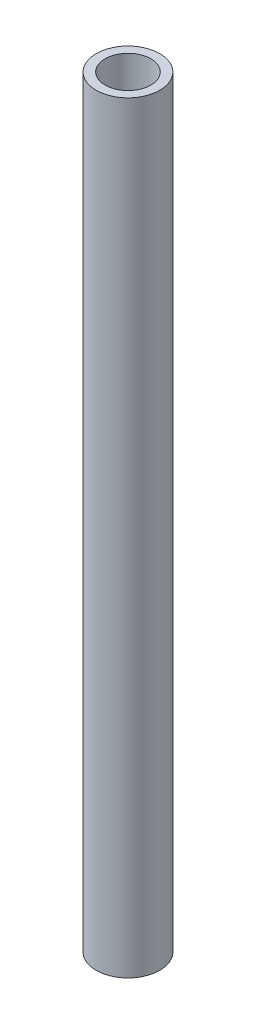
ISO-10303-21;
HEADER;
FILE_DESCRIPTION(('STEP AP214'),'2;1');
FILE_NAME('part.step','',(''),(''),'','','');
FILE_SCHEMA(('AUTOMOTIVE_DESIGN { 1 0 10303 214 1 1 1 1 }'));
ENDSEC;
DATA;
#1=APPLICATION_CONTEXT('core data for automotive mechanical design processes');
#2=APPLICATION_PROTOCOL_DEFINITION('international standard','automotive_design',2000,#1);
#3=PRODUCT_CONTEXT('',#1,'mechanical');
#4=PRODUCT('Part','Part','',(#3));
#5=PRODUCT_RELATED_PRODUCT_CATEGORY('part','',(#4));
#6=PRODUCT_DEFINITION_FORMATION('','',#4);
#7=PRODUCT_DEFINITION_CONTEXT('part definition',#1,'design');
#8=PRODUCT_DEFINITION('design','',#6,#7);
#9=PRODUCT_DEFINITION_SHAPE('','',#8);
#10=(LENGTH_UNIT() NAMED_UNIT(*) SI_UNIT(.MILLI.,.METRE.));
#11=(NAMED_UNIT(*) PLANE_ANGLE_UNIT() SI_UNIT($,.RADIAN.));
#12=(NAMED_UNIT(*) SI_UNIT($,.STERADIAN.) SOLID_ANGLE_UNIT());
#13=UNCERTAINTY_MEASURE_WITH_UNIT(LENGTH_MEASURE(1.E-05),#10,'distance_accuracy_value','');
#14=(GEOMETRIC_REPRESENTATION_CONTEXT(3) GLOBAL_UNCERTAINTY_ASSIGNED_CONTEXT((#13)) GLOBAL_UNIT_ASSIGNED_CONTEXT((#10,
#11,#12)) REPRESENTATION_CONTEXT('',''));
#15=CARTESIAN_POINT('',(0.,0.,0.));
#16=DIRECTION('',(0.,0.,1.));
#17=DIRECTION('',(1.,0.,0.));
#18=AXIS2_PLACEMENT_3D('',#15,#16,#17);
#19=CARTESIAN_POINT('',(0.,76.2,0.));
#20=DIRECTION('',(0.,1.,0.));
#21=DIRECTION('',(0.,0.,1.));
#22=AXIS2_PLACEMENT_3D('',#19,#20,#21);
#23=PLANE('',#22);
#24=CARTESIAN_POINT('',(0.,76.2,0.));
#25=DIRECTION('',(0.,1.,0.));
#26=DIRECTION('',(0.,0.,1.));
#27=AXIS2_PLACEMENT_3D('',#24,#25,#26);
#28=CIRCLE('',#27,3.175);
#29=CARTESIAN_POINT('',(0.,76.2,3.175));
#30=VERTEX_POINT('',#29);
#31=EDGE_CURVE('E10',#30,#30,#28,.T.);
#32=ORIENTED_EDGE('',*,*,#31,.T.);
#33=EDGE_LOOP('',(#32));
#34=FACE_BOUND('',#33,.T.);
#35=CARTESIAN_POINT('',(0.,76.2,0.));
#36=DIRECTION('',(0.,1.,0.));
#37=DIRECTION('',(0.,0.,1.));
#38=AXIS2_PLACEMENT_3D('',#35,#36,#37);
#39=CIRCLE('',#38,2.286);
#40=CARTESIAN_POINT('',(0.,76.2,2.286));
#41=VERTEX_POINT('',#40);
#42=EDGE_CURVE('E44',#41,#41,#39,.T.);
#43=ORIENTED_EDGE('',*,*,#42,.F.);
#44=EDGE_LOOP('',(#43));
#45=FACE_BOUND('',#44,.T.);
#46=ADVANCED_FACE('F33',(#34,#45),#23,.T.);
#47=CARTESIAN_POINT('',(0.,0.,0.));
#48=DIRECTION('',(0.,1.,0.));
#49=DIRECTION('',(0.,0.,1.));
#50=AXIS2_PLACEMENT_3D('',#47,#48,#49);
#51=PLANE('',#50);
#52=CARTESIAN_POINT('',(0.,0.,0.));
#53=DIRECTION('',(0.,1.,0.));
#54=DIRECTION('',(0.,0.,1.));
#55=AXIS2_PLACEMENT_3D('',#52,#53,#54);
#56=CIRCLE('',#55,3.175);
#57=CARTESIAN_POINT('',(0.,0.,3.175));
#58=VERTEX_POINT('',#57);
#59=EDGE_CURVE('E37',#58,#58,#56,.T.);
#60=ORIENTED_EDGE('',*,*,#59,.F.);
#61=EDGE_LOOP('',(#60));
#62=FACE_BOUND('',#61,.T.);
#63=CARTESIAN_POINT('',(0.,0.,0.));
#64=DIRECTION('',(0.,1.,0.));
#65=DIRECTION('',(0.,0.,1.));
#66=AXIS2_PLACEMENT_3D('',#63,#64,#65);
#67=CIRCLE('',#66,2.286);
#68=CARTESIAN_POINT('',(0.,0.,2.286));
#69=VERTEX_POINT('',#68);
#70=EDGE_CURVE('E46',#69,#69,#67,.T.);
#71=ORIENTED_EDGE('',*,*,#70,.T.);
#72=EDGE_LOOP('',(#71));
#73=FACE_BOUND('',#72,.T.);
#74=ADVANCED_FACE('F56',(#62,#73),#51,.F.);
#75=CARTESIAN_POINT('',(0.,76.2,0.));
#76=DIRECTION('',(0.,-1.,0.));
#77=DIRECTION('',(0.,0.,-1.));
#78=AXIS2_PLACEMENT_3D('',#75,#76,#77);
#79=CYLINDRICAL_SURFACE('',#78,3.175);
#80=ORIENTED_EDGE('',*,*,#31,.F.);
#81=EDGE_LOOP('',(#80));
#82=FACE_BOUND('',#81,.T.);
#83=ORIENTED_EDGE('',*,*,#59,.T.);
#84=EDGE_LOOP('',(#83));
#85=FACE_BOUND('',#84,.T.);
#86=ADVANCED_FACE('F35',(#82,#85),#79,.T.);
#87=CARTESIAN_POINT('',(0.,76.2,0.));
#88=DIRECTION('',(0.,-1.,0.));
#89=DIRECTION('',(0.,0.,-1.));
#90=AXIS2_PLACEMENT_3D('',#87,#88,#89);
#91=CYLINDRICAL_SURFACE('',#90,2.286);
#92=ORIENTED_EDGE('',*,*,#42,.T.);
#93=EDGE_LOOP('',(#92));
#94=FACE_BOUND('',#93,.T.);
#95=ORIENTED_EDGE('',*,*,#70,.F.);
#96=EDGE_LOOP('',(#95));
#97=FACE_BOUND('',#96,.T.);
#98=ADVANCED_FACE('F52',(#94,#97),#91,.F.);
#99=CLOSED_SHELL('',(#46,#74,#86,#98));
#100=MANIFOLD_SOLID_BREP('B2',#99);
#101=ADVANCED_BREP_SHAPE_REPRESENTATION('',(#18,#100),#14);
#102=SHAPE_DEFINITION_REPRESENTATION(#9,#101);
ENDSEC;
END-ISO-10303-21;
